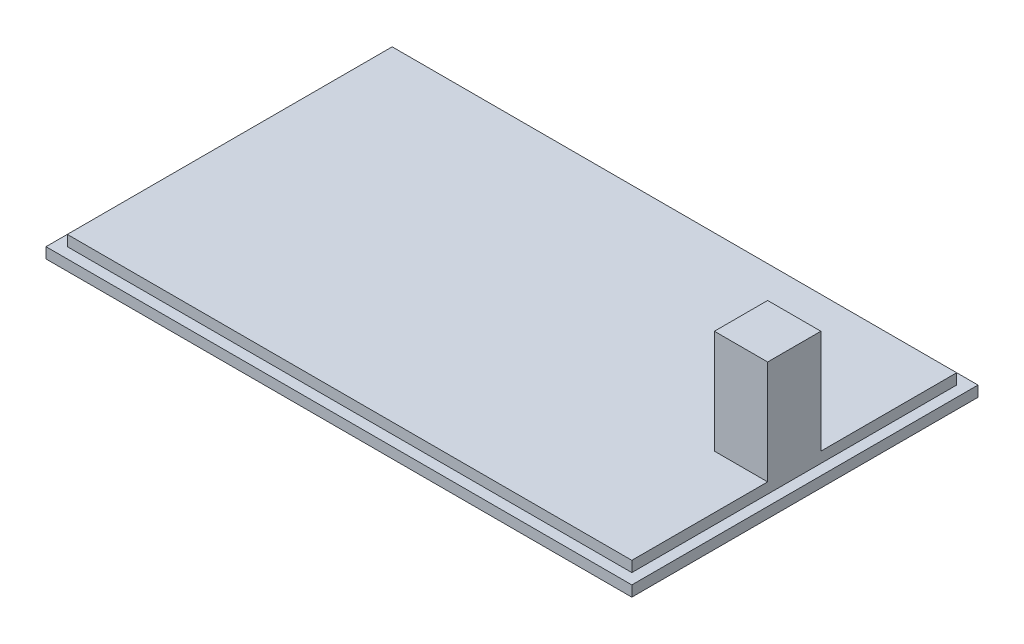
ISO-10303-21;
HEADER;
FILE_DESCRIPTION(('STEP AP214'),'2;1');
FILE_NAME('part.step','',(''),(''),'','','');
FILE_SCHEMA(('AUTOMOTIVE_DESIGN { 1 0 10303 214 1 1 1 1 }'));
ENDSEC;
DATA;
#1=APPLICATION_CONTEXT('core data for automotive mechanical design processes');
#2=APPLICATION_PROTOCOL_DEFINITION('international standard','automotive_design',2000,#1);
#3=PRODUCT_CONTEXT('',#1,'mechanical');
#4=PRODUCT('Part','Part','',(#3));
#5=PRODUCT_RELATED_PRODUCT_CATEGORY('part','',(#4));
#6=PRODUCT_DEFINITION_FORMATION('','',#4);
#7=PRODUCT_DEFINITION_CONTEXT('part definition',#1,'design');
#8=PRODUCT_DEFINITION('design','',#6,#7);
#9=PRODUCT_DEFINITION_SHAPE('','',#8);
#10=(LENGTH_UNIT() NAMED_UNIT(*) SI_UNIT(.MILLI.,.METRE.));
#11=(NAMED_UNIT(*) PLANE_ANGLE_UNIT() SI_UNIT($,.RADIAN.));
#12=(NAMED_UNIT(*) SI_UNIT($,.STERADIAN.) SOLID_ANGLE_UNIT());
#13=UNCERTAINTY_MEASURE_WITH_UNIT(LENGTH_MEASURE(1.E-05),#10,'distance_accuracy_value','');
#14=(GEOMETRIC_REPRESENTATION_CONTEXT(3) GLOBAL_UNCERTAINTY_ASSIGNED_CONTEXT((#13)) GLOBAL_UNIT_ASSIGNED_CONTEXT((#10,
#11,#12)) REPRESENTATION_CONTEXT('',''));
#15=CARTESIAN_POINT('',(0.,0.,0.));
#16=DIRECTION('',(0.,0.,1.));
#17=DIRECTION('',(1.,0.,0.));
#18=AXIS2_PLACEMENT_3D('',#15,#16,#17);
#19=CARTESIAN_POINT('',(0.,2.,0.));
#20=DIRECTION('',(0.,1.,0.));
#21=DIRECTION('',(0.,0.,1.));
#22=AXIS2_PLACEMENT_3D('',#19,#20,#21);
#23=PLANE('',#22);
#24=DIRECTION('',(0.,0.,1.));
#25=VECTOR('',#24,1.);
#26=CARTESIAN_POINT('',(-57.9548734390267,2.,-34.3334558288073));
#27=LINE('',#26,#25);
#28=CARTESIAN_POINT('',(-57.9548734390267,2.,-34.3334558288073));
#29=VERTEX_POINT('',#28);
#30=CARTESIAN_POINT('',(-57.9548734390267,2.,30.6665441711927));
#31=VERTEX_POINT('',#30);
#32=EDGE_CURVE('E193',#29,#31,#27,.T.);
#33=ORIENTED_EDGE('',*,*,#32,.T.);
#34=DIRECTION('',(1.,0.,0.));
#35=VECTOR('',#34,1.);
#36=CARTESIAN_POINT('',(-57.9548734390267,2.,30.6665441711927));
#37=LINE('',#36,#35);
#38=CARTESIAN_POINT('',(52.0451265609733,2.,30.6665441711927));
#39=VERTEX_POINT('',#38);
#40=EDGE_CURVE('E196',#31,#39,#37,.T.);
#41=ORIENTED_EDGE('',*,*,#40,.T.);
#42=DIRECTION('',(0.,0.,-1.));
#43=VECTOR('',#42,1.);
#44=CARTESIAN_POINT('',(52.0451265609733,2.,-34.3334558288073));
#45=LINE('',#44,#43);
#46=CARTESIAN_POINT('',(52.0451265609733,2.,-34.3334558288073));
#47=VERTEX_POINT('',#46);
#48=EDGE_CURVE('E199',#39,#47,#45,.T.);
#49=ORIENTED_EDGE('',*,*,#48,.T.);
#50=DIRECTION('',(-1.,0.,0.));
#51=VECTOR('',#50,1.);
#52=CARTESIAN_POINT('',(-57.9548734390267,2.,-34.3334558288073));
#53=LINE('',#52,#51);
#54=EDGE_CURVE('E201',#47,#29,#53,.T.);
#55=ORIENTED_EDGE('',*,*,#54,.T.);
#56=EDGE_LOOP('',(#33,#41,#49,#55));
#57=FACE_BOUND('',#56,.T.);
#58=DIRECTION('',(0.,0.,1.));
#59=VECTOR('',#58,1.);
#60=CARTESIAN_POINT('',(-55.9548734390267,2.,-32.3334558288073));
#61=LINE('',#60,#59);
#62=CARTESIAN_POINT('',(-55.9548734390267,2.,-32.3334558288073));
#63=VERTEX_POINT('',#62);
#64=CARTESIAN_POINT('',(-55.9548734390267,2.,28.6665441711927));
#65=VERTEX_POINT('',#64);
#66=EDGE_CURVE('E165',#63,#65,#61,.T.);
#67=ORIENTED_EDGE('',*,*,#66,.F.);
#68=DIRECTION('',(1.,0.,0.));
#69=VECTOR('',#68,1.);
#70=CARTESIAN_POINT('',(-55.9548734390267,2.,-32.3334558288073));
#71=LINE('',#70,#69);
#72=CARTESIAN_POINT('',(50.0451265609733,2.,-32.3334558288073));
#73=VERTEX_POINT('',#72);
#74=EDGE_CURVE('E157',#63,#73,#71,.T.);
#75=ORIENTED_EDGE('',*,*,#74,.T.);
#76=DIRECTION('',(0.,0.,1.));
#77=VECTOR('',#76,1.);
#78=CARTESIAN_POINT('',(50.0451265609733,2.,-32.3334558288073));
#79=LINE('',#78,#77);
#80=CARTESIAN_POINT('',(50.0451265609733,2.,28.6665441711927));
#81=VERTEX_POINT('',#80);
#82=EDGE_CURVE('E174',#73,#81,#79,.T.);
#83=ORIENTED_EDGE('',*,*,#82,.T.);
#84=DIRECTION('',(1.,0.,0.));
#85=VECTOR('',#84,1.);
#86=CARTESIAN_POINT('',(-55.9548734390267,2.,28.6665441711927));
#87=LINE('',#86,#85);
#88=EDGE_CURVE('E176',#65,#81,#87,.T.);
#89=ORIENTED_EDGE('',*,*,#88,.F.);
#90=EDGE_LOOP('',(#67,#75,#83,#89));
#91=FACE_BOUND('',#90,.T.);
#92=ADVANCED_FACE('F35',(#57,#91),#23,.T.);
#93=CARTESIAN_POINT('',(-57.9548734390267,2.,-34.3334558288073));
#94=DIRECTION('',(1.,0.,0.));
#95=DIRECTION('',(0.,0.,-1.));
#96=AXIS2_PLACEMENT_3D('',#93,#94,#95);
#97=PLANE('',#96);
#98=DIRECTION('',(0.,0.,1.));
#99=VECTOR('',#98,1.);
#100=CARTESIAN_POINT('',(-57.9548734390267,0.,-34.3334558288073));
#101=LINE('',#100,#99);
#102=CARTESIAN_POINT('',(-57.9548734390267,0.,-34.3334558288073));
#103=VERTEX_POINT('',#102);
#104=CARTESIAN_POINT('',(-57.9548734390267,0.,30.6665441711927));
#105=VERTEX_POINT('',#104);
#106=EDGE_CURVE('E184',#103,#105,#101,.T.);
#107=ORIENTED_EDGE('',*,*,#106,.T.);
#108=DIRECTION('',(0.,-1.,0.));
#109=VECTOR('',#108,1.);
#110=CARTESIAN_POINT('',(-57.9548734390267,2.,30.6665441711927));
#111=LINE('',#110,#109);
#112=EDGE_CURVE('E11',#31,#105,#111,.T.);
#113=ORIENTED_EDGE('',*,*,#112,.F.);
#114=ORIENTED_EDGE('',*,*,#32,.F.);
#115=DIRECTION('',(0.,-1.,0.));
#116=VECTOR('',#115,1.);
#117=CARTESIAN_POINT('',(-57.9548734390267,2.,-34.3334558288073));
#118=LINE('',#117,#116);
#119=EDGE_CURVE('E203',#29,#103,#118,.T.);
#120=ORIENTED_EDGE('',*,*,#119,.T.);
#121=EDGE_LOOP('',(#107,#113,#114,#120));
#122=FACE_BOUND('',#121,.T.);
#123=ADVANCED_FACE('F37',(#122),#97,.F.);
#124=CARTESIAN_POINT('',(-57.9548734390267,2.,30.6665441711927));
#125=DIRECTION('',(0.,0.,-1.));
#126=DIRECTION('',(-1.,0.,0.));
#127=AXIS2_PLACEMENT_3D('',#124,#125,#126);
#128=PLANE('',#127);
#129=DIRECTION('',(1.,0.,0.));
#130=VECTOR('',#129,1.);
#131=CARTESIAN_POINT('',(-57.9548734390267,0.,30.6665441711927));
#132=LINE('',#131,#130);
#133=CARTESIAN_POINT('',(52.0451265609733,0.,30.6665441711927));
#134=VERTEX_POINT('',#133);
#135=EDGE_CURVE('E206',#105,#134,#132,.T.);
#136=ORIENTED_EDGE('',*,*,#135,.T.);
#137=DIRECTION('',(0.,-1.,0.));
#138=VECTOR('',#137,1.);
#139=CARTESIAN_POINT('',(52.0451265609733,2.,30.6665441711927));
#140=LINE('',#139,#138);
#141=EDGE_CURVE('E43',#39,#134,#140,.T.);
#142=ORIENTED_EDGE('',*,*,#141,.F.);
#143=ORIENTED_EDGE('',*,*,#40,.F.);
#144=ORIENTED_EDGE('',*,*,#112,.T.);
#145=EDGE_LOOP('',(#136,#142,#143,#144));
#146=FACE_BOUND('',#145,.T.);
#147=ADVANCED_FACE('F236',(#146),#128,.F.);
#148=CARTESIAN_POINT('',(52.0451265609733,2.,-34.3334558288073));
#149=DIRECTION('',(-1.,0.,0.));
#150=DIRECTION('',(0.,0.,1.));
#151=AXIS2_PLACEMENT_3D('',#148,#149,#150);
#152=PLANE('',#151);
#153=DIRECTION('',(0.,0.,-1.));
#154=VECTOR('',#153,1.);
#155=CARTESIAN_POINT('',(52.0451265609733,0.,-34.3334558288073));
#156=LINE('',#155,#154);
#157=CARTESIAN_POINT('',(52.0451265609733,0.,-34.3334558288073));
#158=VERTEX_POINT('',#157);
#159=EDGE_CURVE('E208',#134,#158,#156,.T.);
#160=ORIENTED_EDGE('',*,*,#159,.T.);
#161=DIRECTION('',(0.,-1.,0.));
#162=VECTOR('',#161,1.);
#163=CARTESIAN_POINT('',(52.0451265609733,2.,-34.3334558288073));
#164=LINE('',#163,#162);
#165=EDGE_CURVE('E213',#47,#158,#164,.T.);
#166=ORIENTED_EDGE('',*,*,#165,.F.);
#167=ORIENTED_EDGE('',*,*,#48,.F.);
#168=ORIENTED_EDGE('',*,*,#141,.T.);
#169=EDGE_LOOP('',(#160,#166,#167,#168));
#170=FACE_BOUND('',#169,.T.);
#171=ADVANCED_FACE('F220',(#170),#152,.F.);
#172=CARTESIAN_POINT('',(-57.9548734390267,2.,-34.3334558288073));
#173=DIRECTION('',(0.,0.,1.));
#174=DIRECTION('',(1.,0.,0.));
#175=AXIS2_PLACEMENT_3D('',#172,#173,#174);
#176=PLANE('',#175);
#177=DIRECTION('',(-1.,0.,0.));
#178=VECTOR('',#177,1.);
#179=CARTESIAN_POINT('',(-57.9548734390267,0.,-34.3334558288073));
#180=LINE('',#179,#178);
#181=EDGE_CURVE('E197',#158,#103,#180,.T.);
#182=ORIENTED_EDGE('',*,*,#181,.T.);
#183=ORIENTED_EDGE('',*,*,#119,.F.);
#184=ORIENTED_EDGE('',*,*,#54,.F.);
#185=ORIENTED_EDGE('',*,*,#165,.T.);
#186=EDGE_LOOP('',(#182,#183,#184,#185));
#187=FACE_BOUND('',#186,.T.);
#188=ADVANCED_FACE('F229',(#187),#176,.F.);
#189=CARTESIAN_POINT('',(0.,0.,0.));
#190=DIRECTION('',(0.,1.,0.));
#191=DIRECTION('',(0.,0.,1.));
#192=AXIS2_PLACEMENT_3D('',#189,#190,#191);
#193=PLANE('',#192);
#194=ORIENTED_EDGE('',*,*,#106,.F.);
#195=ORIENTED_EDGE('',*,*,#181,.F.);
#196=ORIENTED_EDGE('',*,*,#159,.F.);
#197=ORIENTED_EDGE('',*,*,#135,.F.);
#198=EDGE_LOOP('',(#194,#195,#196,#197));
#199=FACE_BOUND('',#198,.T.);
#200=ADVANCED_FACE('F226',(#199),#193,.F.);
#201=CARTESIAN_POINT('',(-55.9548734390267,4.,-32.3334558288073));
#202=DIRECTION('',(0.,0.,-1.));
#203=DIRECTION('',(-1.,0.,0.));
#204=AXIS2_PLACEMENT_3D('',#201,#202,#203);
#205=PLANE('',#204);
#206=ORIENTED_EDGE('',*,*,#74,.F.);
#207=DIRECTION('',(0.,-1.,0.));
#208=VECTOR('',#207,1.);
#209=CARTESIAN_POINT('',(-55.9548734390267,4.,-32.3334558288073));
#210=LINE('',#209,#208);
#211=CARTESIAN_POINT('',(-55.9548734390267,4.,-32.3334558288073));
#212=VERTEX_POINT('',#211);
#213=EDGE_CURVE('E181',#212,#63,#210,.T.);
#214=ORIENTED_EDGE('',*,*,#213,.F.);
#215=DIRECTION('',(1.,0.,0.));
#216=VECTOR('',#215,1.);
#217=CARTESIAN_POINT('',(-55.9548734390267,4.,-32.3334558288073));
#218=LINE('',#217,#216);
#219=CARTESIAN_POINT('',(50.0451265609733,4.,-32.3334558288073));
#220=VERTEX_POINT('',#219);
#221=EDGE_CURVE('E162',#212,#220,#218,.T.);
#222=ORIENTED_EDGE('',*,*,#221,.T.);
#223=DIRECTION('',(0.,-1.,0.));
#224=VECTOR('',#223,1.);
#225=CARTESIAN_POINT('',(50.0451265609733,4.,-32.3334558288073));
#226=LINE('',#225,#224);
#227=EDGE_CURVE('E172',#220,#73,#226,.T.);
#228=ORIENTED_EDGE('',*,*,#227,.T.);
#229=EDGE_LOOP('',(#206,#214,#222,#228));
#230=FACE_BOUND('',#229,.T.);
#231=ADVANCED_FACE('F249',(#230),#205,.T.);
#232=CARTESIAN_POINT('',(-55.9548734390267,4.,-32.3334558288073));
#233=DIRECTION('',(1.,0.,0.));
#234=DIRECTION('',(0.,0.,-1.));
#235=AXIS2_PLACEMENT_3D('',#232,#233,#234);
#236=PLANE('',#235);
#237=ORIENTED_EDGE('',*,*,#66,.T.);
#238=DIRECTION('',(0.,-1.,0.));
#239=VECTOR('',#238,1.);
#240=CARTESIAN_POINT('',(-55.9548734390267,4.,28.6665441711927));
#241=LINE('',#240,#239);
#242=CARTESIAN_POINT('',(-55.9548734390267,4.,28.6665441711927));
#243=VERTEX_POINT('',#242);
#244=EDGE_CURVE('E185',#243,#65,#241,.T.);
#245=ORIENTED_EDGE('',*,*,#244,.F.);
#246=DIRECTION('',(0.,0.,1.));
#247=VECTOR('',#246,1.);
#248=CARTESIAN_POINT('',(-55.9548734390267,4.,-32.3334558288073));
#249=LINE('',#248,#247);
#250=EDGE_CURVE('E170',#212,#243,#249,.T.);
#251=ORIENTED_EDGE('',*,*,#250,.F.);
#252=ORIENTED_EDGE('',*,*,#213,.T.);
#253=EDGE_LOOP('',(#237,#245,#251,#252));
#254=FACE_BOUND('',#253,.T.);
#255=ADVANCED_FACE('F268',(#254),#236,.F.);
#256=CARTESIAN_POINT('',(-55.9548734390267,4.,28.6665441711927));
#257=DIRECTION('',(0.,0.,-1.));
#258=DIRECTION('',(-1.,0.,0.));
#259=AXIS2_PLACEMENT_3D('',#256,#257,#258);
#260=PLANE('',#259);
#261=ORIENTED_EDGE('',*,*,#88,.T.);
#262=DIRECTION('',(0.,-1.,0.));
#263=VECTOR('',#262,1.);
#264=CARTESIAN_POINT('',(50.0451265609733,4.,28.6665441711927));
#265=LINE('',#264,#263);
#266=CARTESIAN_POINT('',(50.0451265609733,4.,28.6665441711927));
#267=VERTEX_POINT('',#266);
#268=EDGE_CURVE('E188',#267,#81,#265,.T.);
#269=ORIENTED_EDGE('',*,*,#268,.F.);
#270=DIRECTION('',(1.,0.,0.));
#271=VECTOR('',#270,1.);
#272=CARTESIAN_POINT('',(-55.9548734390267,4.,28.6665441711927));
#273=LINE('',#272,#271);
#274=EDGE_CURVE('E168',#243,#267,#273,.T.);
#275=ORIENTED_EDGE('',*,*,#274,.F.);
#276=ORIENTED_EDGE('',*,*,#244,.T.);
#277=EDGE_LOOP('',(#261,#269,#275,#276));
#278=FACE_BOUND('',#277,.T.);
#279=ADVANCED_FACE('F275',(#278),#260,.F.);
#280=CARTESIAN_POINT('',(50.0451265609733,4.,-32.3334558288073));
#281=DIRECTION('',(1.,0.,0.));
#282=DIRECTION('',(0.,0.,-1.));
#283=AXIS2_PLACEMENT_3D('',#280,#281,#282);
#284=PLANE('',#283);
#285=ORIENTED_EDGE('',*,*,#82,.F.);
#286=ORIENTED_EDGE('',*,*,#227,.F.);
#287=DIRECTION('',(0.,0.,1.));
#288=VECTOR('',#287,1.);
#289=CARTESIAN_POINT('',(50.0451265609733,4.,-32.3334558288073));
#290=LINE('',#289,#288);
#291=CARTESIAN_POINT('',(50.0451265609733,4.,-6.83345582880728));
#292=VERTEX_POINT('',#291);
#293=EDGE_CURVE('E166',#220,#292,#290,.T.);
#294=ORIENTED_EDGE('',*,*,#293,.T.);
#295=DIRECTION('',(0.,-1.,0.));
#296=VECTOR('',#295,1.);
#297=CARTESIAN_POINT('',(50.0451265609733,23.5,-6.83345582880727));
#298=LINE('',#297,#296);
#299=CARTESIAN_POINT('',(50.0451265609733,23.5,-6.83345582880727));
#300=VERTEX_POINT('',#299);
#301=EDGE_CURVE('E143',#300,#292,#298,.T.);
#302=ORIENTED_EDGE('',*,*,#301,.F.);
#303=DIRECTION('',(0.,0.,1.));
#304=VECTOR('',#303,1.);
#305=CARTESIAN_POINT('',(50.0451265609733,23.5,-6.83345582880727));
#306=LINE('',#305,#304);
#307=CARTESIAN_POINT('',(50.0451265609733,23.5,3.16654417119273));
#308=VERTEX_POINT('',#307);
#309=EDGE_CURVE('E134',#300,#308,#306,.T.);
#310=ORIENTED_EDGE('',*,*,#309,.T.);
#311=DIRECTION('',(0.,-1.,0.));
#312=VECTOR('',#311,1.);
#313=CARTESIAN_POINT('',(50.0451265609733,23.5,3.16654417119273));
#314=LINE('',#313,#312);
#315=CARTESIAN_POINT('',(50.0451265609733,4.,3.16654417119272));
#316=VERTEX_POINT('',#315);
#317=EDGE_CURVE('E122',#308,#316,#314,.T.);
#318=ORIENTED_EDGE('',*,*,#317,.T.);
#319=EDGE_CURVE('E55',#316,#267,#290,.T.);
#320=ORIENTED_EDGE('',*,*,#319,.T.);
#321=ORIENTED_EDGE('',*,*,#268,.T.);
#322=EDGE_LOOP('',(#285,#286,#294,#302,#310,#318,#320,#321));
#323=FACE_BOUND('',#322,.T.);
#324=ADVANCED_FACE('F140',(#323),#284,.T.);
#325=CARTESIAN_POINT('',(0.,4.,0.));
#326=DIRECTION('',(0.,-1.,0.));
#327=DIRECTION('',(0.,0.,-1.));
#328=AXIS2_PLACEMENT_3D('',#325,#326,#327);
#329=PLANE('',#328);
#330=ORIENTED_EDGE('',*,*,#319,.F.);
#331=DIRECTION('',(-1.,0.,0.));
#332=VECTOR('',#331,1.);
#333=CARTESIAN_POINT('',(50.0451265609733,4.,3.16654417119273));
#334=LINE('',#333,#332);
#335=CARTESIAN_POINT('',(40.0451265609733,4.,3.16654417119273));
#336=VERTEX_POINT('',#335);
#337=EDGE_CURVE('E50',#316,#336,#334,.T.);
#338=ORIENTED_EDGE('',*,*,#337,.T.);
#339=DIRECTION('',(0.,0.,1.));
#340=VECTOR('',#339,1.);
#341=CARTESIAN_POINT('',(40.0451265609733,4.,-6.83345582880727));
#342=LINE('',#341,#340);
#343=CARTESIAN_POINT('',(40.0451265609733,4.,-6.83345582880727));
#344=VERTEX_POINT('',#343);
#345=EDGE_CURVE('E148',#344,#336,#342,.T.);
#346=ORIENTED_EDGE('',*,*,#345,.F.);
#347=DIRECTION('',(-1.,0.,0.));
#348=VECTOR('',#347,1.);
#349=CARTESIAN_POINT('',(50.0451265609733,4.,-6.83345582880727));
#350=LINE('',#349,#348);
#351=EDGE_CURVE('E145',#292,#344,#350,.T.);
#352=ORIENTED_EDGE('',*,*,#351,.F.);
#353=ORIENTED_EDGE('',*,*,#293,.F.);
#354=ORIENTED_EDGE('',*,*,#221,.F.);
#355=ORIENTED_EDGE('',*,*,#250,.T.);
#356=ORIENTED_EDGE('',*,*,#274,.T.);
#357=EDGE_LOOP('',(#330,#338,#346,#352,#353,#354,#355,#356));
#358=FACE_BOUND('',#357,.T.);
#359=ADVANCED_FACE('F290',(#358),#329,.F.);
#360=CARTESIAN_POINT('',(50.0451265609733,23.5,-6.83345582880727));
#361=DIRECTION('',(0.,0.,1.));
#362=DIRECTION('',(1.,0.,0.));
#363=AXIS2_PLACEMENT_3D('',#360,#361,#362);
#364=PLANE('',#363);
#365=ORIENTED_EDGE('',*,*,#351,.T.);
#366=DIRECTION('',(0.,-1.,0.));
#367=VECTOR('',#366,1.);
#368=CARTESIAN_POINT('',(40.0451265609733,23.5,-6.83345582880727));
#369=LINE('',#368,#367);
#370=CARTESIAN_POINT('',(40.0451265609733,23.5,-6.83345582880727));
#371=VERTEX_POINT('',#370);
#372=EDGE_CURVE('E158',#371,#344,#369,.T.);
#373=ORIENTED_EDGE('',*,*,#372,.F.);
#374=DIRECTION('',(-1.,0.,0.));
#375=VECTOR('',#374,1.);
#376=CARTESIAN_POINT('',(50.0451265609733,23.5,-6.83345582880727));
#377=LINE('',#376,#375);
#378=EDGE_CURVE('E129',#300,#371,#377,.T.);
#379=ORIENTED_EDGE('',*,*,#378,.F.);
#380=ORIENTED_EDGE('',*,*,#301,.T.);
#381=EDGE_LOOP('',(#365,#373,#379,#380));
#382=FACE_BOUND('',#381,.T.);
#383=ADVANCED_FACE('F296',(#382),#364,.F.);
#384=CARTESIAN_POINT('',(40.0451265609733,23.5,-6.83345582880727));
#385=DIRECTION('',(1.,0.,0.));
#386=DIRECTION('',(0.,0.,-1.));
#387=AXIS2_PLACEMENT_3D('',#384,#385,#386);
#388=PLANE('',#387);
#389=ORIENTED_EDGE('',*,*,#345,.T.);
#390=DIRECTION('',(0.,-1.,0.));
#391=VECTOR('',#390,1.);
#392=CARTESIAN_POINT('',(40.0451265609733,23.5,3.16654417119273));
#393=LINE('',#392,#391);
#394=CARTESIAN_POINT('',(40.0451265609733,23.5,3.16654417119273));
#395=VERTEX_POINT('',#394);
#396=EDGE_CURVE('E128',#395,#336,#393,.T.);
#397=ORIENTED_EDGE('',*,*,#396,.F.);
#398=DIRECTION('',(0.,0.,1.));
#399=VECTOR('',#398,1.);
#400=CARTESIAN_POINT('',(40.0451265609733,23.5,-6.83345582880727));
#401=LINE('',#400,#399);
#402=EDGE_CURVE('E136',#371,#395,#401,.T.);
#403=ORIENTED_EDGE('',*,*,#402,.F.);
#404=ORIENTED_EDGE('',*,*,#372,.T.);
#405=EDGE_LOOP('',(#389,#397,#403,#404));
#406=FACE_BOUND('',#405,.T.);
#407=ADVANCED_FACE('F303',(#406),#388,.F.);
#408=CARTESIAN_POINT('',(50.0451265609733,23.5,3.16654417119273));
#409=DIRECTION('',(0.,0.,1.));
#410=DIRECTION('',(1.,0.,0.));
#411=AXIS2_PLACEMENT_3D('',#408,#409,#410);
#412=PLANE('',#411);
#413=ORIENTED_EDGE('',*,*,#337,.F.);
#414=ORIENTED_EDGE('',*,*,#317,.F.);
#415=DIRECTION('',(-1.,0.,0.));
#416=VECTOR('',#415,1.);
#417=CARTESIAN_POINT('',(50.0451265609733,23.5,3.16654417119273));
#418=LINE('',#417,#416);
#419=EDGE_CURVE('E125',#308,#395,#418,.T.);
#420=ORIENTED_EDGE('',*,*,#419,.T.);
#421=ORIENTED_EDGE('',*,*,#396,.T.);
#422=EDGE_LOOP('',(#413,#414,#420,#421));
#423=FACE_BOUND('',#422,.T.);
#424=ADVANCED_FACE('F124',(#423),#412,.T.);
#425=CARTESIAN_POINT('',(0.,23.5,0.));
#426=DIRECTION('',(0.,-1.,0.));
#427=DIRECTION('',(0.,0.,-1.));
#428=AXIS2_PLACEMENT_3D('',#425,#426,#427);
#429=PLANE('',#428);
#430=ORIENTED_EDGE('',*,*,#309,.F.);
#431=ORIENTED_EDGE('',*,*,#378,.T.);
#432=ORIENTED_EDGE('',*,*,#402,.T.);
#433=ORIENTED_EDGE('',*,*,#419,.F.);
#434=EDGE_LOOP('',(#430,#431,#432,#433));
#435=FACE_BOUND('',#434,.T.);
#436=ADVANCED_FACE('F133',(#435),#429,.F.);
#437=CLOSED_SHELL('',(#92,#123,#147,#171,#188,#200,#231,#255,#279,#324,#359,#383,#407,#424,#436));
#438=MANIFOLD_SOLID_BREP('B2',#437);
#439=ADVANCED_BREP_SHAPE_REPRESENTATION('',(#18,#438),#14);
#440=SHAPE_DEFINITION_REPRESENTATION(#9,#439);
ENDSEC;
END-ISO-10303-21;
